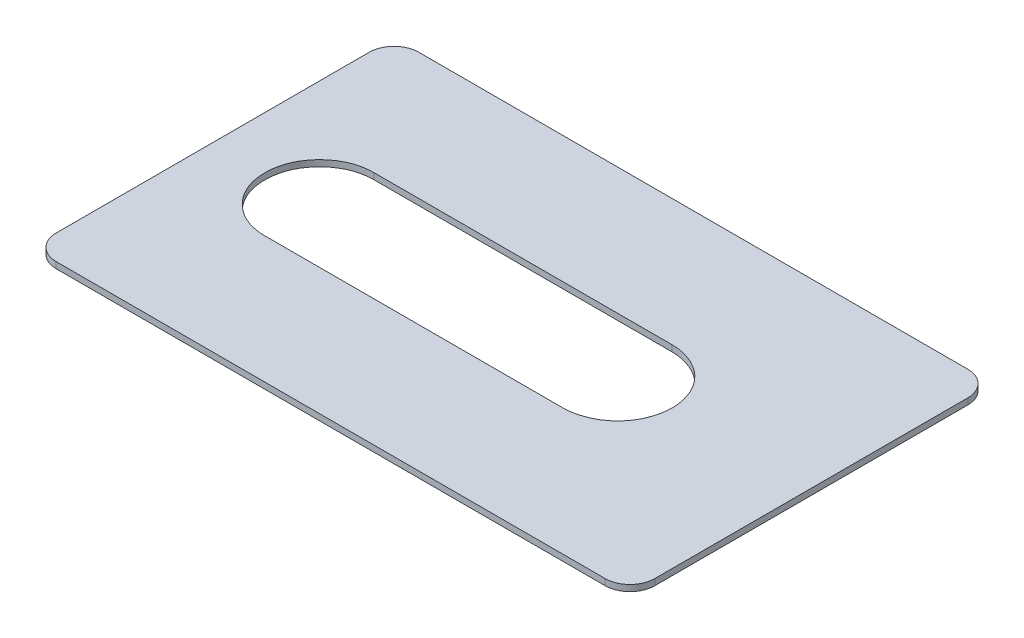
ISO-10303-21;
HEADER;
FILE_DESCRIPTION(('STEP AP214'),'2;1');
FILE_NAME('part.step','',(''),(''),'','','');
FILE_SCHEMA(('AUTOMOTIVE_DESIGN { 1 0 10303 214 1 1 1 1 }'));
ENDSEC;
DATA;
#1=APPLICATION_CONTEXT('core data for automotive mechanical design processes');
#2=APPLICATION_PROTOCOL_DEFINITION('international standard','automotive_design',2000,#1);
#3=PRODUCT_CONTEXT('',#1,'mechanical');
#4=PRODUCT('Part','Part','',(#3));
#5=PRODUCT_RELATED_PRODUCT_CATEGORY('part','',(#4));
#6=PRODUCT_DEFINITION_FORMATION('','',#4);
#7=PRODUCT_DEFINITION_CONTEXT('part definition',#1,'design');
#8=PRODUCT_DEFINITION('design','',#6,#7);
#9=PRODUCT_DEFINITION_SHAPE('','',#8);
#10=(LENGTH_UNIT() NAMED_UNIT(*) SI_UNIT(.MILLI.,.METRE.));
#11=(NAMED_UNIT(*) PLANE_ANGLE_UNIT() SI_UNIT($,.RADIAN.));
#12=(NAMED_UNIT(*) SI_UNIT($,.STERADIAN.) SOLID_ANGLE_UNIT());
#13=UNCERTAINTY_MEASURE_WITH_UNIT(LENGTH_MEASURE(1.E-05),#10,'distance_accuracy_value','');
#14=(GEOMETRIC_REPRESENTATION_CONTEXT(3) GLOBAL_UNCERTAINTY_ASSIGNED_CONTEXT((#13)) GLOBAL_UNIT_ASSIGNED_CONTEXT((#10,
#11,#12)) REPRESENTATION_CONTEXT('',''));
#15=CARTESIAN_POINT('',(0.,0.,0.));
#16=DIRECTION('',(0.,0.,1.));
#17=DIRECTION('',(1.,0.,0.));
#18=AXIS2_PLACEMENT_3D('',#15,#16,#17);
#19=CARTESIAN_POINT('',(12.7996245082532,0.25,-6.3));
#20=DIRECTION('',(0.,-1.,0.));
#21=DIRECTION('',(0.,0.,-1.));
#22=AXIS2_PLACEMENT_3D('',#19,#20,#21);
#23=PLANE('',#22);
#24=CARTESIAN_POINT('',(12.7996245082532,0.25,-6.3));
#25=DIRECTION('',(0.,1.,0.));
#26=DIRECTION('',(0.,0.,-1.));
#27=AXIS2_PLACEMENT_3D('',#24,#25,#26);
#28=CIRCLE('',#27,1.);
#29=CARTESIAN_POINT('',(13.7996245082532,0.25,-6.3));
#30=VERTEX_POINT('',#29);
#31=CARTESIAN_POINT('',(12.7996245082532,0.25,-7.3));
#32=VERTEX_POINT('',#31);
#33=EDGE_CURVE('E239',#30,#32,#28,.T.);
#34=ORIENTED_EDGE('',*,*,#33,.T.);
#35=DIRECTION('',(-1.,0.,0.));
#36=VECTOR('',#35,1.);
#37=CARTESIAN_POINT('',(12.7996245082532,0.25,-7.3));
#38=LINE('',#37,#36);
#39=CARTESIAN_POINT('',(-9.30037549174677,0.25,-7.3));
#40=VERTEX_POINT('',#39);
#41=EDGE_CURVE('E264',#32,#40,#38,.T.);
#42=ORIENTED_EDGE('',*,*,#41,.T.);
#43=CARTESIAN_POINT('',(-9.30037549174677,0.25,-6.3));
#44=DIRECTION('',(0.,1.,0.));
#45=DIRECTION('',(0.,0.,1.));
#46=AXIS2_PLACEMENT_3D('',#43,#44,#45);
#47=CIRCLE('',#46,1.);
#48=CARTESIAN_POINT('',(-10.3003754917468,0.25,-6.3));
#49=VERTEX_POINT('',#48);
#50=EDGE_CURVE('E221',#40,#49,#47,.T.);
#51=ORIENTED_EDGE('',*,*,#50,.T.);
#52=DIRECTION('',(0.,0.,1.));
#53=VECTOR('',#52,1.);
#54=CARTESIAN_POINT('',(-10.3003754917468,0.25,-6.3));
#55=LINE('',#54,#53);
#56=CARTESIAN_POINT('',(-10.3003754917468,0.25,6.3));
#57=VERTEX_POINT('',#56);
#58=EDGE_CURVE('E258',#49,#57,#55,.T.);
#59=ORIENTED_EDGE('',*,*,#58,.T.);
#60=CARTESIAN_POINT('',(-9.30037549174677,0.25,6.3));
#61=DIRECTION('',(0.,1.,0.));
#62=DIRECTION('',(0.,0.,1.));
#63=AXIS2_PLACEMENT_3D('',#60,#61,#62);
#64=CIRCLE('',#63,1.);
#65=CARTESIAN_POINT('',(-9.30037549174677,0.25,7.3));
#66=VERTEX_POINT('',#65);
#67=EDGE_CURVE('E260',#57,#66,#64,.T.);
#68=ORIENTED_EDGE('',*,*,#67,.T.);
#69=DIRECTION('',(1.,0.,0.));
#70=VECTOR('',#69,1.);
#71=CARTESIAN_POINT('',(-9.30037549174677,0.25,7.3));
#72=LINE('',#71,#70);
#73=CARTESIAN_POINT('',(12.7996245082532,0.25,7.3));
#74=VERTEX_POINT('',#73);
#75=EDGE_CURVE('E262',#66,#74,#72,.T.);
#76=ORIENTED_EDGE('',*,*,#75,.T.);
#77=CARTESIAN_POINT('',(12.7996245082532,0.25,6.3));
#78=DIRECTION('',(0.,1.,0.));
#79=DIRECTION('',(0.,0.,1.));
#80=AXIS2_PLACEMENT_3D('',#77,#78,#79);
#81=CIRCLE('',#80,1.);
#82=CARTESIAN_POINT('',(13.7996245082532,0.25,6.3));
#83=VERTEX_POINT('',#82);
#84=EDGE_CURVE('E269',#74,#83,#81,.T.);
#85=ORIENTED_EDGE('',*,*,#84,.T.);
#86=DIRECTION('',(0.,0.,-1.));
#87=VECTOR('',#86,1.);
#88=CARTESIAN_POINT('',(13.7996245082532,0.25,6.3));
#89=LINE('',#88,#87);
#90=EDGE_CURVE('E244',#83,#30,#89,.T.);
#91=ORIENTED_EDGE('',*,*,#90,.T.);
#92=EDGE_LOOP('',(#34,#42,#51,#59,#68,#76,#85,#91));
#93=FACE_BOUND('',#92,.T.);
#94=CARTESIAN_POINT('',(-6.,0.25,-2.2));
#95=CARTESIAN_POINT('',(-6.28646321091853,0.25,-2.2));
#96=CARTESIAN_POINT('',(-6.86932223368721,0.25,-2.09652800088215));
#97=CARTESIAN_POINT('',(-7.59195149826217,0.25,-1.59212777948567));
#98=CARTESIAN_POINT('',(-8.09630771841,0.25,-0.869143794962976));
#99=CARTESIAN_POINT('',(-8.25169833810894,0.25,0.000240671490065982));
#100=CARTESIAN_POINT('',(-8.09689881291215,0.25,0.867652922411912));
#101=CARTESIAN_POINT('',(-7.59177494053543,0.25,1.59232806130745));
#102=CARTESIAN_POINT('',(-6.87018433873364,0.25,2.0964707775045));
#103=CARTESIAN_POINT('',(-6.2866320351743,0.25,2.20000000000001));
#104=CARTESIAN_POINT('',(-6.,0.25,2.20000000000001));
#105=B_SPLINE_CURVE_WITH_KNOTS('',3,(#94,#95,#96,#97,#98,#99,#100,#101,#102,#103,#104),
.UNSPECIFIED.,.F.,.F.,(4,1,1,1,1,1,1,1,4),(0.,0.125,0.25,0.375,0.5,0.625,0.75,0.875,1.),.UNSPECIFIED.);
#106=CARTESIAN_POINT('',(-6.,0.25,-2.2));
#107=VERTEX_POINT('',#106);
#108=CARTESIAN_POINT('',(-6.,0.25,2.20000000000001));
#109=VERTEX_POINT('',#108);
#110=EDGE_CURVE('E126',#107,#109,#105,.T.);
#111=ORIENTED_EDGE('',*,*,#110,.F.);
#112=DIRECTION('',(-1.,0.,0.));
#113=VECTOR('',#112,1.);
#114=CARTESIAN_POINT('',(-6.,0.25,-2.2));
#115=LINE('',#114,#113);
#116=CARTESIAN_POINT('',(6.,0.25,-2.2));
#117=VERTEX_POINT('',#116);
#118=EDGE_CURVE('E148',#117,#107,#115,.T.);
#119=ORIENTED_EDGE('',*,*,#118,.F.);
#120=CARTESIAN_POINT('',(6.,0.25,2.2));
#121=CARTESIAN_POINT('',(6.56124593543533,0.25,2.19999999999999));
#122=CARTESIAN_POINT('',(7.73055429313528,0.25,1.72401412372995));
#123=CARTESIAN_POINT('',(8.4346823248297,0.25,7.82169895769498E-05));
#124=CARTESIAN_POINT('',(7.73071632317092,0.25,-1.72387699169879));
#125=CARTESIAN_POINT('',(6.56129212941102,0.25,-2.20000000000001));
#126=CARTESIAN_POINT('',(6.,0.25,-2.2));
#127=B_SPLINE_CURVE_WITH_KNOTS('',3,(#120,#121,#122,#123,#124,#125,#126),.UNSPECIFIED.,.F.,.F.,
(4,1,1,1,4),(0.,0.25,0.5,0.75,1.),.UNSPECIFIED.);
#128=CARTESIAN_POINT('',(6.,0.25,2.2));
#129=VERTEX_POINT('',#128);
#130=EDGE_CURVE('E146',#129,#117,#127,.T.);
#131=ORIENTED_EDGE('',*,*,#130,.F.);
#132=DIRECTION('',(1.,0.,0.));
#133=VECTOR('',#132,1.);
#134=CARTESIAN_POINT('',(6.,0.25,2.2));
#135=LINE('',#134,#133);
#136=EDGE_CURVE('E134',#109,#129,#135,.T.);
#137=ORIENTED_EDGE('',*,*,#136,.F.);
#138=EDGE_LOOP('',(#111,#119,#131,#137));
#139=FACE_BOUND('',#138,.T.);
#140=ADVANCED_FACE('F37',(#93,#139),#23,.F.);
#141=CARTESIAN_POINT('',(12.7996245082532,0.,-6.3));
#142=DIRECTION('',(0.,-1.,0.));
#143=DIRECTION('',(0.,0.,-1.));
#144=AXIS2_PLACEMENT_3D('',#141,#142,#143);
#145=PLANE('',#144);
#146=CARTESIAN_POINT('',(12.7996245082532,0.,-6.3));
#147=DIRECTION('',(0.,1.,0.));
#148=DIRECTION('',(0.,0.,-1.));
#149=AXIS2_PLACEMENT_3D('',#146,#147,#148);
#150=CIRCLE('',#149,1.);
#151=CARTESIAN_POINT('',(13.7996245082532,0.,-6.3));
#152=VERTEX_POINT('',#151);
#153=CARTESIAN_POINT('',(12.7996245082532,0.,-7.3));
#154=VERTEX_POINT('',#153);
#155=EDGE_CURVE('E142',#152,#154,#150,.T.);
#156=ORIENTED_EDGE('',*,*,#155,.F.);
#157=DIRECTION('',(0.,0.,-1.));
#158=VECTOR('',#157,1.);
#159=CARTESIAN_POINT('',(13.7996245082532,0.,6.3));
#160=LINE('',#159,#158);
#161=CARTESIAN_POINT('',(13.7996245082532,0.,6.3));
#162=VERTEX_POINT('',#161);
#163=EDGE_CURVE('E237',#162,#152,#160,.T.);
#164=ORIENTED_EDGE('',*,*,#163,.F.);
#165=CARTESIAN_POINT('',(12.7996245082532,0.,6.3));
#166=DIRECTION('',(0.,1.,0.));
#167=DIRECTION('',(0.,0.,1.));
#168=AXIS2_PLACEMENT_3D('',#165,#166,#167);
#169=CIRCLE('',#168,1.);
#170=CARTESIAN_POINT('',(12.7996245082532,0.,7.3));
#171=VERTEX_POINT('',#170);
#172=EDGE_CURVE('E235',#171,#162,#169,.T.);
#173=ORIENTED_EDGE('',*,*,#172,.F.);
#174=DIRECTION('',(1.,0.,0.));
#175=VECTOR('',#174,1.);
#176=CARTESIAN_POINT('',(-9.30037549174677,0.,7.3));
#177=LINE('',#176,#175);
#178=CARTESIAN_POINT('',(-9.30037549174677,0.,7.3));
#179=VERTEX_POINT('',#178);
#180=EDGE_CURVE('E233',#179,#171,#177,.T.);
#181=ORIENTED_EDGE('',*,*,#180,.F.);
#182=CARTESIAN_POINT('',(-9.30037549174677,0.,6.3));
#183=DIRECTION('',(0.,1.,0.));
#184=DIRECTION('',(0.,0.,1.));
#185=AXIS2_PLACEMENT_3D('',#182,#183,#184);
#186=CIRCLE('',#185,1.);
#187=CARTESIAN_POINT('',(-10.3003754917468,0.,6.3));
#188=VERTEX_POINT('',#187);
#189=EDGE_CURVE('E228',#188,#179,#186,.T.);
#190=ORIENTED_EDGE('',*,*,#189,.F.);
#191=DIRECTION('',(0.,0.,1.));
#192=VECTOR('',#191,1.);
#193=CARTESIAN_POINT('',(-10.3003754917468,0.,-6.3));
#194=LINE('',#193,#192);
#195=CARTESIAN_POINT('',(-10.3003754917468,0.,-6.3));
#196=VERTEX_POINT('',#195);
#197=EDGE_CURVE('E226',#196,#188,#194,.T.);
#198=ORIENTED_EDGE('',*,*,#197,.F.);
#199=CARTESIAN_POINT('',(-9.30037549174677,0.,-6.3));
#200=DIRECTION('',(0.,1.,0.));
#201=DIRECTION('',(0.,0.,1.));
#202=AXIS2_PLACEMENT_3D('',#199,#200,#201);
#203=CIRCLE('',#202,1.);
#204=CARTESIAN_POINT('',(-9.30037549174677,0.,-7.3));
#205=VERTEX_POINT('',#204);
#206=EDGE_CURVE('E217',#205,#196,#203,.T.);
#207=ORIENTED_EDGE('',*,*,#206,.F.);
#208=DIRECTION('',(-1.,0.,0.));
#209=VECTOR('',#208,1.);
#210=CARTESIAN_POINT('',(12.7996245082532,0.,-7.3));
#211=LINE('',#210,#209);
#212=EDGE_CURVE('E210',#154,#205,#211,.T.);
#213=ORIENTED_EDGE('',*,*,#212,.F.);
#214=EDGE_LOOP('',(#156,#164,#173,#181,#190,#198,#207,#213));
#215=FACE_BOUND('',#214,.T.);
#216=DIRECTION('',(-1.,0.,0.));
#217=VECTOR('',#216,1.);
#218=CARTESIAN_POINT('',(-6.,0.,-2.2));
#219=LINE('',#218,#217);
#220=CARTESIAN_POINT('',(6.,0.,-2.2));
#221=VERTEX_POINT('',#220);
#222=CARTESIAN_POINT('',(-6.,0.,-2.2));
#223=VERTEX_POINT('',#222);
#224=EDGE_CURVE('E135',#221,#223,#219,.T.);
#225=ORIENTED_EDGE('',*,*,#224,.T.);
#226=CARTESIAN_POINT('',(-6.,0.,-2.2));
#227=CARTESIAN_POINT('',(-6.28646321091853,0.,-2.2));
#228=CARTESIAN_POINT('',(-6.86932223368721,0.,-2.09652800088215));
#229=CARTESIAN_POINT('',(-7.59195149826217,0.,-1.59212777948567));
#230=CARTESIAN_POINT('',(-8.09630771841,0.,-0.869143794962976));
#231=CARTESIAN_POINT('',(-8.25169833810894,0.,0.000240671490065982));
#232=CARTESIAN_POINT('',(-8.09689881291215,0.,0.867652922411912));
#233=CARTESIAN_POINT('',(-7.59177494053543,0.,1.59232806130745));
#234=CARTESIAN_POINT('',(-6.87018433873364,0.,2.0964707775045));
#235=CARTESIAN_POINT('',(-6.2866320351743,0.,2.20000000000001));
#236=CARTESIAN_POINT('',(-6.,0.,2.20000000000001));
#237=B_SPLINE_CURVE_WITH_KNOTS('',3,(#226,#227,#228,#229,#230,#231,#232,#233,#234,#235,#236),
.UNSPECIFIED.,.F.,.F.,(4,1,1,1,1,1,1,1,4),(0.,0.125,0.25,0.375,0.5,0.625,0.75,0.875,1.),.UNSPECIFIED.);
#238=CARTESIAN_POINT('',(-6.,0.,2.20000000000001));
#239=VERTEX_POINT('',#238);
#240=EDGE_CURVE('E60',#223,#239,#237,.T.);
#241=ORIENTED_EDGE('',*,*,#240,.T.);
#242=DIRECTION('',(1.,0.,0.));
#243=VECTOR('',#242,1.);
#244=CARTESIAN_POINT('',(6.,0.,2.2));
#245=LINE('',#244,#243);
#246=CARTESIAN_POINT('',(6.,0.,2.2));
#247=VERTEX_POINT('',#246);
#248=EDGE_CURVE('E141',#239,#247,#245,.T.);
#249=ORIENTED_EDGE('',*,*,#248,.T.);
#250=CARTESIAN_POINT('',(6.,0.,2.2));
#251=CARTESIAN_POINT('',(6.56124593543533,0.,2.19999999999999));
#252=CARTESIAN_POINT('',(7.73055429313528,0.,1.72401412372995));
#253=CARTESIAN_POINT('',(8.4346823248297,0.,7.82169895769498E-05));
#254=CARTESIAN_POINT('',(7.73071632317092,0.,-1.72387699169879));
#255=CARTESIAN_POINT('',(6.56129212941102,0.,-2.20000000000001));
#256=CARTESIAN_POINT('',(6.,0.,-2.2));
#257=B_SPLINE_CURVE_WITH_KNOTS('',3,(#250,#251,#252,#253,#254,#255,#256),.UNSPECIFIED.,.F.,.F.,
(4,1,1,1,4),(0.,0.25,0.5,0.75,1.),.UNSPECIFIED.);
#258=EDGE_CURVE('E290',#247,#221,#257,.T.);
#259=ORIENTED_EDGE('',*,*,#258,.T.);
#260=EDGE_LOOP('',(#225,#241,#249,#259));
#261=FACE_BOUND('',#260,.T.);
#262=ADVANCED_FACE('F175',(#215,#261),#145,.T.);
#263=CARTESIAN_POINT('',(12.7996245082532,0.25,-6.3));
#264=DIRECTION('',(0.,-1.,0.));
#265=DIRECTION('',(0.,0.,-1.));
#266=AXIS2_PLACEMENT_3D('',#263,#264,#265);
#267=CYLINDRICAL_SURFACE('',#266,1.);
#268=ORIENTED_EDGE('',*,*,#155,.T.);
#269=DIRECTION('',(0.,-1.,0.));
#270=VECTOR('',#269,1.);
#271=CARTESIAN_POINT('',(12.7996245082532,0.25,-7.3));
#272=LINE('',#271,#270);
#273=EDGE_CURVE('E11',#32,#154,#272,.T.);
#274=ORIENTED_EDGE('',*,*,#273,.F.);
#275=ORIENTED_EDGE('',*,*,#33,.F.);
#276=DIRECTION('',(0.,-1.,0.));
#277=VECTOR('',#276,1.);
#278=CARTESIAN_POINT('',(13.7996245082532,0.25,-6.3));
#279=LINE('',#278,#277);
#280=EDGE_CURVE('E240',#30,#152,#279,.T.);
#281=ORIENTED_EDGE('',*,*,#280,.T.);
#282=EDGE_LOOP('',(#268,#274,#275,#281));
#283=FACE_BOUND('',#282,.T.);
#284=ADVANCED_FACE('F39',(#283),#267,.T.);
#285=CARTESIAN_POINT('',(12.7996245082532,0.25,-7.3));
#286=DIRECTION('',(0.,0.,1.));
#287=DIRECTION('',(1.,0.,0.));
#288=AXIS2_PLACEMENT_3D('',#285,#286,#287);
#289=PLANE('',#288);
#290=ORIENTED_EDGE('',*,*,#212,.T.);
#291=DIRECTION('',(0.,-1.,0.));
#292=VECTOR('',#291,1.);
#293=CARTESIAN_POINT('',(-9.30037549174677,0.25,-7.3));
#294=LINE('',#293,#292);
#295=EDGE_CURVE('E45',#40,#205,#294,.T.);
#296=ORIENTED_EDGE('',*,*,#295,.F.);
#297=ORIENTED_EDGE('',*,*,#41,.F.);
#298=ORIENTED_EDGE('',*,*,#273,.T.);
#299=EDGE_LOOP('',(#290,#296,#297,#298));
#300=FACE_BOUND('',#299,.T.);
#301=ADVANCED_FACE('F201',(#300),#289,.F.);
#302=CARTESIAN_POINT('',(-9.30037549174677,0.25,-6.3));
#303=DIRECTION('',(0.,-1.,0.));
#304=DIRECTION('',(0.,0.,-1.));
#305=AXIS2_PLACEMENT_3D('',#302,#303,#304);
#306=CYLINDRICAL_SURFACE('',#305,1.);
#307=ORIENTED_EDGE('',*,*,#206,.T.);
#308=DIRECTION('',(0.,-1.,0.));
#309=VECTOR('',#308,1.);
#310=CARTESIAN_POINT('',(-10.3003754917468,0.25,-6.3));
#311=LINE('',#310,#309);
#312=EDGE_CURVE('E222',#49,#196,#311,.T.);
#313=ORIENTED_EDGE('',*,*,#312,.F.);
#314=ORIENTED_EDGE('',*,*,#50,.F.);
#315=ORIENTED_EDGE('',*,*,#295,.T.);
#316=EDGE_LOOP('',(#307,#313,#314,#315));
#317=FACE_BOUND('',#316,.T.);
#318=ADVANCED_FACE('F198',(#317),#306,.T.);
#319=CARTESIAN_POINT('',(-10.3003754917468,0.25,-6.3));
#320=DIRECTION('',(1.,0.,0.));
#321=DIRECTION('',(0.,0.,-1.));
#322=AXIS2_PLACEMENT_3D('',#319,#320,#321);
#323=PLANE('',#322);
#324=ORIENTED_EDGE('',*,*,#197,.T.);
#325=DIRECTION('',(0.,-1.,0.));
#326=VECTOR('',#325,1.);
#327=CARTESIAN_POINT('',(-10.3003754917468,0.25,6.3));
#328=LINE('',#327,#326);
#329=EDGE_CURVE('E253',#57,#188,#328,.T.);
#330=ORIENTED_EDGE('',*,*,#329,.F.);
#331=ORIENTED_EDGE('',*,*,#58,.F.);
#332=ORIENTED_EDGE('',*,*,#312,.T.);
#333=EDGE_LOOP('',(#324,#330,#331,#332));
#334=FACE_BOUND('',#333,.T.);
#335=ADVANCED_FACE('F194',(#334),#323,.F.);
#336=CARTESIAN_POINT('',(-9.30037549174677,0.25,6.3));
#337=DIRECTION('',(0.,-1.,0.));
#338=DIRECTION('',(0.,0.,-1.));
#339=AXIS2_PLACEMENT_3D('',#336,#337,#338);
#340=CYLINDRICAL_SURFACE('',#339,1.);
#341=ORIENTED_EDGE('',*,*,#189,.T.);
#342=DIRECTION('',(0.,-1.,0.));
#343=VECTOR('',#342,1.);
#344=CARTESIAN_POINT('',(-9.30037549174677,0.25,7.3));
#345=LINE('',#344,#343);
#346=EDGE_CURVE('E250',#66,#179,#345,.T.);
#347=ORIENTED_EDGE('',*,*,#346,.F.);
#348=ORIENTED_EDGE('',*,*,#67,.F.);
#349=ORIENTED_EDGE('',*,*,#329,.T.);
#350=EDGE_LOOP('',(#341,#347,#348,#349));
#351=FACE_BOUND('',#350,.T.);
#352=ADVANCED_FACE('F190',(#351),#340,.T.);
#353=CARTESIAN_POINT('',(-9.30037549174677,0.25,7.3));
#354=DIRECTION('',(0.,0.,-1.));
#355=DIRECTION('',(-1.,0.,0.));
#356=AXIS2_PLACEMENT_3D('',#353,#354,#355);
#357=PLANE('',#356);
#358=ORIENTED_EDGE('',*,*,#180,.T.);
#359=DIRECTION('',(0.,-1.,0.));
#360=VECTOR('',#359,1.);
#361=CARTESIAN_POINT('',(12.7996245082532,0.25,7.3));
#362=LINE('',#361,#360);
#363=EDGE_CURVE('E247',#74,#171,#362,.T.);
#364=ORIENTED_EDGE('',*,*,#363,.F.);
#365=ORIENTED_EDGE('',*,*,#75,.F.);
#366=ORIENTED_EDGE('',*,*,#346,.T.);
#367=EDGE_LOOP('',(#358,#364,#365,#366));
#368=FACE_BOUND('',#367,.T.);
#369=ADVANCED_FACE('F186',(#368),#357,.F.);
#370=CARTESIAN_POINT('',(12.7996245082532,0.25,6.3));
#371=DIRECTION('',(0.,-1.,0.));
#372=DIRECTION('',(0.,0.,-1.));
#373=AXIS2_PLACEMENT_3D('',#370,#371,#372);
#374=CYLINDRICAL_SURFACE('',#373,1.);
#375=ORIENTED_EDGE('',*,*,#172,.T.);
#376=DIRECTION('',(0.,-1.,0.));
#377=VECTOR('',#376,1.);
#378=CARTESIAN_POINT('',(13.7996245082532,0.25,6.3));
#379=LINE('',#378,#377);
#380=EDGE_CURVE('E243',#83,#162,#379,.T.);
#381=ORIENTED_EDGE('',*,*,#380,.F.);
#382=ORIENTED_EDGE('',*,*,#84,.F.);
#383=ORIENTED_EDGE('',*,*,#363,.T.);
#384=EDGE_LOOP('',(#375,#381,#382,#383));
#385=FACE_BOUND('',#384,.T.);
#386=ADVANCED_FACE('F182',(#385),#374,.T.);
#387=CARTESIAN_POINT('',(13.7996245082532,0.25,6.3));
#388=DIRECTION('',(-1.,0.,0.));
#389=DIRECTION('',(0.,0.,1.));
#390=AXIS2_PLACEMENT_3D('',#387,#388,#389);
#391=PLANE('',#390);
#392=ORIENTED_EDGE('',*,*,#163,.T.);
#393=ORIENTED_EDGE('',*,*,#280,.F.);
#394=ORIENTED_EDGE('',*,*,#90,.F.);
#395=ORIENTED_EDGE('',*,*,#380,.T.);
#396=EDGE_LOOP('',(#392,#393,#394,#395));
#397=FACE_BOUND('',#396,.T.);
#398=ADVANCED_FACE('F172',(#397),#391,.F.);
#399=DIRECTION('',(0.,-1.,0.));
#400=VECTOR('',#399,1.);
#401=SURFACE_OF_LINEAR_EXTRUSION('',#105,#400);
#402=ORIENTED_EDGE('',*,*,#240,.F.);
#403=DIRECTION('',(0.,-1.,0.));
#404=VECTOR('',#403,1.);
#405=CARTESIAN_POINT('',(-6.,0.25,-2.2));
#406=LINE('',#405,#404);
#407=EDGE_CURVE('E130',#107,#223,#406,.T.);
#408=ORIENTED_EDGE('',*,*,#407,.F.);
#409=ORIENTED_EDGE('',*,*,#110,.T.);
#410=DIRECTION('',(0.,-1.,0.));
#411=VECTOR('',#410,1.);
#412=CARTESIAN_POINT('',(-6.,0.25,2.20000000000001));
#413=LINE('',#412,#411);
#414=EDGE_CURVE('E129',#109,#239,#413,.T.);
#415=ORIENTED_EDGE('',*,*,#414,.T.);
#416=EDGE_LOOP('',(#402,#408,#409,#415));
#417=FACE_BOUND('',#416,.T.);
#418=ADVANCED_FACE('F128',(#417),#401,.T.);
#419=CARTESIAN_POINT('',(6.,0.25,2.2));
#420=DIRECTION('',(0.,0.,-1.));
#421=DIRECTION('',(-1.,0.,0.));
#422=AXIS2_PLACEMENT_3D('',#419,#420,#421);
#423=PLANE('',#422);
#424=ORIENTED_EDGE('',*,*,#248,.F.);
#425=ORIENTED_EDGE('',*,*,#414,.F.);
#426=ORIENTED_EDGE('',*,*,#136,.T.);
#427=DIRECTION('',(0.,-1.,0.));
#428=VECTOR('',#427,1.);
#429=CARTESIAN_POINT('',(6.,0.25,2.2));
#430=LINE('',#429,#428);
#431=EDGE_CURVE('E143',#129,#247,#430,.T.);
#432=ORIENTED_EDGE('',*,*,#431,.T.);
#433=EDGE_LOOP('',(#424,#425,#426,#432));
#434=FACE_BOUND('',#433,.T.);
#435=ADVANCED_FACE('F138',(#434),#423,.T.);
#436=DIRECTION('',(0.,-1.,0.));
#437=VECTOR('',#436,1.);
#438=SURFACE_OF_LINEAR_EXTRUSION('',#127,#437);
#439=ORIENTED_EDGE('',*,*,#258,.F.);
#440=ORIENTED_EDGE('',*,*,#431,.F.);
#441=ORIENTED_EDGE('',*,*,#130,.T.);
#442=DIRECTION('',(0.,-1.,0.));
#443=VECTOR('',#442,1.);
#444=CARTESIAN_POINT('',(6.,0.25,-2.2));
#445=LINE('',#444,#443);
#446=EDGE_CURVE('E52',#117,#221,#445,.T.);
#447=ORIENTED_EDGE('',*,*,#446,.T.);
#448=EDGE_LOOP('',(#439,#440,#441,#447));
#449=FACE_BOUND('',#448,.T.);
#450=ADVANCED_FACE('F162',(#449),#438,.T.);
#451=CARTESIAN_POINT('',(-6.,0.25,-2.2));
#452=DIRECTION('',(0.,0.,1.));
#453=DIRECTION('',(1.,0.,0.));
#454=AXIS2_PLACEMENT_3D('',#451,#452,#453);
#455=PLANE('',#454);
#456=ORIENTED_EDGE('',*,*,#224,.F.);
#457=ORIENTED_EDGE('',*,*,#446,.F.);
#458=ORIENTED_EDGE('',*,*,#118,.T.);
#459=ORIENTED_EDGE('',*,*,#407,.T.);
#460=EDGE_LOOP('',(#456,#457,#458,#459));
#461=FACE_BOUND('',#460,.T.);
#462=ADVANCED_FACE('F166',(#461),#455,.T.);
#463=CLOSED_SHELL('',(#140,#262,#284,#301,#318,#335,#352,#369,#386,#398,#418,#435,#450,#462));
#464=MANIFOLD_SOLID_BREP('B2',#463);
#465=ADVANCED_BREP_SHAPE_REPRESENTATION('',(#18,#464),#14);
#466=SHAPE_DEFINITION_REPRESENTATION(#9,#465);
ENDSEC;
END-ISO-10303-21;
